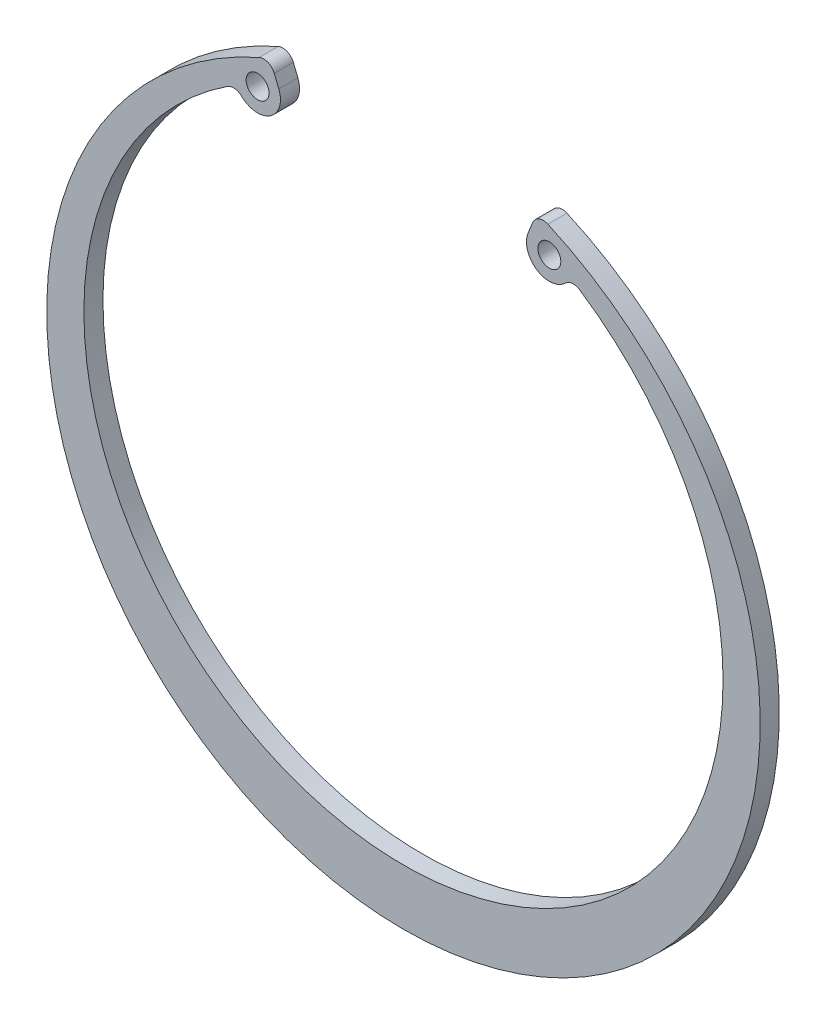
ISO-10303-21;
HEADER;
FILE_DESCRIPTION(('STEP AP214'),'2;1');
FILE_NAME('part.step','',(''),(''),'','','');
FILE_SCHEMA(('AUTOMOTIVE_DESIGN { 1 0 10303 214 1 1 1 1 }'));
ENDSEC;
DATA;
#1=APPLICATION_CONTEXT('core data for automotive mechanical design processes');
#2=APPLICATION_PROTOCOL_DEFINITION('international standard','automotive_design',2000,#1);
#3=PRODUCT_CONTEXT('',#1,'mechanical');
#4=PRODUCT('Part','Part','',(#3));
#5=PRODUCT_RELATED_PRODUCT_CATEGORY('part','',(#4));
#6=PRODUCT_DEFINITION_FORMATION('','',#4);
#7=PRODUCT_DEFINITION_CONTEXT('part definition',#1,'design');
#8=PRODUCT_DEFINITION('design','',#6,#7);
#9=PRODUCT_DEFINITION_SHAPE('','',#8);
#10=(LENGTH_UNIT() NAMED_UNIT(*) SI_UNIT(.MILLI.,.METRE.));
#11=(NAMED_UNIT(*) PLANE_ANGLE_UNIT() SI_UNIT($,.RADIAN.));
#12=(NAMED_UNIT(*) SI_UNIT($,.STERADIAN.) SOLID_ANGLE_UNIT());
#13=UNCERTAINTY_MEASURE_WITH_UNIT(LENGTH_MEASURE(1.E-05),#10,'distance_accuracy_value','');
#14=(GEOMETRIC_REPRESENTATION_CONTEXT(3) GLOBAL_UNCERTAINTY_ASSIGNED_CONTEXT((#13)) GLOBAL_UNIT_ASSIGNED_CONTEXT((#10,
#11,#12)) REPRESENTATION_CONTEXT('',''));
#15=CARTESIAN_POINT('',(0.,0.,0.));
#16=DIRECTION('',(0.,0.,1.));
#17=DIRECTION('',(1.,0.,0.));
#18=AXIS2_PLACEMENT_3D('',#15,#16,#17);
#19=CARTESIAN_POINT('',(16.3384573068,40.4736619647,2.5));
#20=DIRECTION('',(0.927294931547796,-0.374331550801918,0.));
#21=DIRECTION('',(0.374331550801918,0.927294931547796,0.));
#22=AXIS2_PLACEMENT_3D('',#19,#20,#21);
#23=PLANE('',#22);
#24=DIRECTION('',(0.374331550801918,0.927294931547796,0.));
#25=VECTOR('',#24,1.);
#26=CARTESIAN_POINT('',(16.3384573068,40.4736619647,2.5));
#27=LINE('',#26,#25);
#28=CARTESIAN_POINT('',(16.929193530201,41.9370350217967,2.5));
#29=VERTEX_POINT('',#28);
#30=CARTESIAN_POINT('',(16.3384573067783,40.4736619647029,2.5));
#31=VERTEX_POINT('',#30);
#32=EDGE_CURVE('E123',#29,#31,#27,.F.);
#33=ORIENTED_EDGE('',*,*,#32,.F.);
#34=DIRECTION('',(0.,0.,-1.));
#35=VECTOR('',#34,1.);
#36=CARTESIAN_POINT('',(16.9291935301803,41.9370350218079,0.));
#37=LINE('',#36,#35);
#38=CARTESIAN_POINT('',(16.9291935301846,41.9370350217902,0.));
#39=VERTEX_POINT('',#38);
#40=EDGE_CURVE('E172',#39,#29,#37,.F.);
#41=ORIENTED_EDGE('',*,*,#40,.F.);
#42=DIRECTION('',(-0.374331550786946,-0.92729493155384,0.));
#43=VECTOR('',#42,1.);
#44=CARTESIAN_POINT('',(16.9291935302,41.9370350218,0.));
#45=LINE('',#44,#43);
#46=CARTESIAN_POINT('',(16.3384573067692,40.4736619646804,0.));
#47=VERTEX_POINT('',#46);
#48=EDGE_CURVE('E101',#39,#47,#45,.T.);
#49=ORIENTED_EDGE('',*,*,#48,.T.);
#50=DIRECTION('',(0.,0.,1.));
#51=VECTOR('',#50,1.);
#52=CARTESIAN_POINT('',(16.3384573067607,40.4736619647159,2.5));
#53=LINE('',#52,#51);
#54=EDGE_CURVE('E171',#31,#47,#53,.F.);
#55=ORIENTED_EDGE('',*,*,#54,.F.);
#56=EDGE_LOOP('',(#33,#41,#49,#55));
#57=FACE_BOUND('',#56,.T.);
#58=ADVANCED_FACE('F17',(#57),#23,.F.);
#59=CARTESIAN_POINT('',(-17.5,43.3510380499,2.5));
#60=DIRECTION('',(-0.927294931547796,-0.374331550801918,0.));
#61=DIRECTION('',(0.374331550801918,-0.927294931547796,0.));
#62=AXIS2_PLACEMENT_3D('',#59,#60,#61);
#63=PLANE('',#62);
#64=DIRECTION('',(0.374331550801918,-0.927294931547796,0.));
#65=VECTOR('',#64,1.);
#66=CARTESIAN_POINT('',(-17.5,43.3510380499,2.5));
#67=LINE('',#66,#65);
#68=CARTESIAN_POINT('',(-16.3384573067632,40.473661964709,2.5));
#69=VERTEX_POINT('',#68);
#70=CARTESIAN_POINT('',(-16.9291935301859,41.9370350218028,2.5));
#71=VERTEX_POINT('',#70);
#72=EDGE_CURVE('E35',#69,#71,#67,.F.);
#73=ORIENTED_EDGE('',*,*,#72,.F.);
#74=DIRECTION('',(0.,0.,1.));
#75=VECTOR('',#74,1.);
#76=CARTESIAN_POINT('',(-16.3384573067607,40.4736619647159,2.5));
#77=LINE('',#76,#75);
#78=CARTESIAN_POINT('',(-16.3384573067692,40.4736619646804,0.));
#79=VERTEX_POINT('',#78);
#80=EDGE_CURVE('E160',#79,#69,#77,.T.);
#81=ORIENTED_EDGE('',*,*,#80,.F.);
#82=DIRECTION('',(-0.374331550786946,0.92729493155384,0.));
#83=VECTOR('',#82,1.);
#84=CARTESIAN_POINT('',(-16.3384573068,40.4736619647,0.));
#85=LINE('',#84,#83);
#86=CARTESIAN_POINT('',(-16.9291935301846,41.9370350217902,0.));
#87=VERTEX_POINT('',#86);
#88=EDGE_CURVE('E88',#79,#87,#85,.T.);
#89=ORIENTED_EDGE('',*,*,#88,.T.);
#90=DIRECTION('',(0.,0.,1.));
#91=VECTOR('',#90,1.);
#92=CARTESIAN_POINT('',(-16.9291935301803,41.9370350218079,0.));
#93=LINE('',#92,#91);
#94=EDGE_CURVE('E99',#71,#87,#93,.F.);
#95=ORIENTED_EDGE('',*,*,#94,.F.);
#96=EDGE_LOOP('',(#73,#81,#89,#95));
#97=FACE_BOUND('',#96,.T.);
#98=ADVANCED_FACE('F181',(#97),#63,.F.);
#99=CARTESIAN_POINT('',(0.,0.,0.));
#100=DIRECTION('',(0.,0.,1.));
#101=DIRECTION('',(1.,0.,0.));
#102=AXIS2_PLACEMENT_3D('',#99,#100,#101);
#103=PLANE('',#102);
#104=CARTESIAN_POINT('',(-19.1203421014,39.3506673123,0.));
#105=DIRECTION('',(0.,0.,-1.));
#106=DIRECTION('',(-1.,0.,0.));
#107=AXIS2_PLACEMENT_3D('',#104,#105,#106);
#108=CIRCLE('',#107,1.5);
#109=CARTESIAN_POINT('',(-20.6203421014,39.3506673123,0.));
#110=VERTEX_POINT('',#109);
#111=EDGE_CURVE('E148',#110,#110,#108,.F.);
#112=ORIENTED_EDGE('',*,*,#111,.T.);
#113=EDGE_LOOP('',(#112));
#114=FACE_BOUND('',#113,.T.);
#115=CARTESIAN_POINT('',(19.1203421014,39.3506673123,0.));
#116=DIRECTION('',(0.,0.,-1.));
#117=DIRECTION('',(-1.,0.,0.));
#118=AXIS2_PLACEMENT_3D('',#115,#116,#117);
#119=CIRCLE('',#118,1.5);
#120=CARTESIAN_POINT('',(17.6203421014,39.3506673123,0.));
#121=VERTEX_POINT('',#120);
#122=EDGE_CURVE('E151',#121,#121,#119,.F.);
#123=ORIENTED_EDGE('',*,*,#122,.T.);
#124=EDGE_LOOP('',(#123));
#125=FACE_BOUND('',#124,.T.);
#126=CARTESIAN_POINT('',(-22.2604379554,36.1273463497,0.));
#127=DIRECTION('',(0.,0.,-1.));
#128=DIRECTION('',(-1.,0.,0.));
#129=AXIS2_PLACEMENT_3D('',#126,#127,#128);
#130=CIRCLE('',#129,1.5);
#131=CARTESIAN_POINT('',(-21.2137393374052,37.201786670578,0.));
#132=VERTEX_POINT('',#131);
#133=CARTESIAN_POINT('',(-23.0872804712713,37.3788779928688,0.));
#134=VERTEX_POINT('',#133);
#135=EDGE_CURVE('E158',#132,#134,#130,.F.);
#136=ORIENTED_EDGE('',*,*,#135,.T.);
#137=CARTESIAN_POINT('',(0.,2.43333333333,0.));
#138=DIRECTION('',(0.,0.,1.));
#139=DIRECTION('',(1.,0.,0.));
#140=AXIS2_PLACEMENT_3D('',#137,#138,#139);
#141=CIRCLE('',#140,41.8833333333);
#142=CARTESIAN_POINT('',(23.0872804712538,37.3788779928425,0.));
#143=VERTEX_POINT('',#142);
#144=EDGE_CURVE('E162',#134,#143,#141,.T.);
#145=ORIENTED_EDGE('',*,*,#144,.T.);
#146=CARTESIAN_POINT('',(22.2604379554,36.1273463497,0.));
#147=DIRECTION('',(0.,0.,-1.));
#148=DIRECTION('',(-1.,0.,0.));
#149=AXIS2_PLACEMENT_3D('',#146,#147,#148);
#150=CIRCLE('',#149,1.5);
#151=CARTESIAN_POINT('',(21.2137393374052,37.201786670578,0.));
#152=VERTEX_POINT('',#151);
#153=EDGE_CURVE('E165',#143,#152,#150,.F.);
#154=ORIENTED_EDGE('',*,*,#153,.T.);
#155=CARTESIAN_POINT('',(19.1203421014,39.3506673123,0.));
#156=DIRECTION('',(0.,0.,1.));
#157=DIRECTION('',(1.,0.,0.));
#158=AXIS2_PLACEMENT_3D('',#155,#156,#157);
#159=CIRCLE('',#158,3.);
#160=EDGE_CURVE('E169',#47,#152,#159,.T.);
#161=ORIENTED_EDGE('',*,*,#160,.F.);
#162=ORIENTED_EDGE('',*,*,#48,.F.);
#163=CARTESIAN_POINT('',(18.3201359275,41.3755376956,0.));
#164=DIRECTION('',(0.,0.,-1.));
#165=DIRECTION('',(-1.,0.,0.));
#166=AXIS2_PLACEMENT_3D('',#163,#164,#165);
#167=CIRCLE('',#166,1.5);
#168=CARTESIAN_POINT('',(18.9274332510718,42.7471024810723,0.));
#169=VERTEX_POINT('',#168);
#170=EDGE_CURVE('E107',#169,#39,#167,.F.);
#171=ORIENTED_EDGE('',*,*,#170,.F.);
#172=CARTESIAN_POINT('',(0.,0.,0.));
#173=DIRECTION('',(0.,0.,1.));
#174=DIRECTION('',(1.,0.,0.));
#175=AXIS2_PLACEMENT_3D('',#172,#173,#174);
#176=CIRCLE('',#175,46.75);
#177=CARTESIAN_POINT('',(-18.9274332510718,42.7471024810723,0.));
#178=VERTEX_POINT('',#177);
#179=EDGE_CURVE('E103',#178,#169,#176,.T.);
#180=ORIENTED_EDGE('',*,*,#179,.F.);
#181=CARTESIAN_POINT('',(-18.3201359275,41.3755376956,0.));
#182=DIRECTION('',(0.,0.,1.));
#183=DIRECTION('',(1.,0.,0.));
#184=AXIS2_PLACEMENT_3D('',#181,#182,#183);
#185=CIRCLE('',#184,1.5);
#186=EDGE_CURVE('E20',#87,#178,#185,.T.);
#187=ORIENTED_EDGE('',*,*,#186,.F.);
#188=ORIENTED_EDGE('',*,*,#88,.F.);
#189=CARTESIAN_POINT('',(-19.1203421014,39.3506673123,0.));
#190=DIRECTION('',(0.,0.,1.));
#191=DIRECTION('',(1.,0.,0.));
#192=AXIS2_PLACEMENT_3D('',#189,#190,#191);
#193=CIRCLE('',#192,3.);
#194=EDGE_CURVE('E154',#132,#79,#193,.T.);
#195=ORIENTED_EDGE('',*,*,#194,.F.);
#196=EDGE_LOOP('',(#136,#145,#154,#161,#162,#171,#180,#187,#188,#195));
#197=FACE_BOUND('',#196,.T.);
#198=ADVANCED_FACE('F105',(#114,#125,#197),#103,.F.);
#199=CARTESIAN_POINT('',(-18.3201359275,41.3755376956,0.));
#200=DIRECTION('',(0.,0.,1.));
#201=DIRECTION('',(1.,0.,0.));
#202=AXIS2_PLACEMENT_3D('',#199,#200,#201);
#203=CYLINDRICAL_SURFACE('',#202,1.5);
#204=CARTESIAN_POINT('',(-18.3201359275,41.3755376956,2.5));
#205=DIRECTION('',(0.,0.,1.));
#206=DIRECTION('',(1.,0.,0.));
#207=AXIS2_PLACEMENT_3D('',#204,#205,#206);
#208=CIRCLE('',#207,1.5);
#209=CARTESIAN_POINT('',(-18.9274332510672,42.7471024810618,2.5));
#210=VERTEX_POINT('',#209);
#211=EDGE_CURVE('E146',#71,#210,#208,.T.);
#212=ORIENTED_EDGE('',*,*,#211,.F.);
#213=ORIENTED_EDGE('',*,*,#94,.T.);
#214=ORIENTED_EDGE('',*,*,#186,.T.);
#215=DIRECTION('',(0.,0.,1.));
#216=VECTOR('',#215,1.);
#217=CARTESIAN_POINT('',(-18.9274332510805,42.7471024810559,0.));
#218=LINE('',#217,#216);
#219=EDGE_CURVE('E97',#210,#178,#218,.F.);
#220=ORIENTED_EDGE('',*,*,#219,.F.);
#221=EDGE_LOOP('',(#212,#213,#214,#220));
#222=FACE_BOUND('',#221,.T.);
#223=ADVANCED_FACE('F95',(#222),#203,.T.);
#224=CARTESIAN_POINT('',(0.,0.,0.));
#225=DIRECTION('',(0.,0.,1.));
#226=DIRECTION('',(1.,0.,0.));
#227=AXIS2_PLACEMENT_3D('',#224,#225,#226);
#228=CYLINDRICAL_SURFACE('',#227,46.75);
#229=DIRECTION('',(0.,0.,-1.));
#230=VECTOR('',#229,1.);
#231=CARTESIAN_POINT('',(18.9274332510898,42.747102481077,0.));
#232=LINE('',#231,#230);
#233=CARTESIAN_POINT('',(18.9274332510765,42.7471024810829,2.5));
#234=VERTEX_POINT('',#233);
#235=EDGE_CURVE('E110',#234,#169,#232,.T.);
#236=ORIENTED_EDGE('',*,*,#235,.F.);
#237=CARTESIAN_POINT('',(0.,0.,2.5));
#238=DIRECTION('',(0.,0.,1.));
#239=DIRECTION('',(1.,0.,0.));
#240=AXIS2_PLACEMENT_3D('',#237,#238,#239);
#241=CIRCLE('',#240,46.75);
#242=EDGE_CURVE('E113',#210,#234,#241,.T.);
#243=ORIENTED_EDGE('',*,*,#242,.F.);
#244=ORIENTED_EDGE('',*,*,#219,.T.);
#245=ORIENTED_EDGE('',*,*,#179,.T.);
#246=EDGE_LOOP('',(#236,#243,#244,#245));
#247=FACE_BOUND('',#246,.T.);
#248=ADVANCED_FACE('F111',(#247),#228,.T.);
#249=CARTESIAN_POINT('',(18.3201359275,41.3755376956,0.));
#250=DIRECTION('',(0.,0.,-1.));
#251=DIRECTION('',(-1.,0.,0.));
#252=AXIS2_PLACEMENT_3D('',#249,#250,#251);
#253=CYLINDRICAL_SURFACE('',#252,1.5);
#254=ORIENTED_EDGE('',*,*,#170,.T.);
#255=ORIENTED_EDGE('',*,*,#40,.T.);
#256=CARTESIAN_POINT('',(18.3201359275,41.3755376956,2.5));
#257=DIRECTION('',(0.,0.,-1.));
#258=DIRECTION('',(-1.,0.,0.));
#259=AXIS2_PLACEMENT_3D('',#256,#257,#258);
#260=CIRCLE('',#259,1.5);
#261=EDGE_CURVE('E142',#234,#29,#260,.F.);
#262=ORIENTED_EDGE('',*,*,#261,.F.);
#263=ORIENTED_EDGE('',*,*,#235,.T.);
#264=EDGE_LOOP('',(#254,#255,#262,#263));
#265=FACE_BOUND('',#264,.T.);
#266=ADVANCED_FACE('F176',(#265),#253,.T.);
#267=CARTESIAN_POINT('',(19.1203421014,39.3506673123,2.5));
#268=DIRECTION('',(0.,0.,1.));
#269=DIRECTION('',(1.,0.,0.));
#270=AXIS2_PLACEMENT_3D('',#267,#268,#269);
#271=CYLINDRICAL_SURFACE('',#270,3.);
#272=ORIENTED_EDGE('',*,*,#54,.T.);
#273=ORIENTED_EDGE('',*,*,#160,.T.);
#274=DIRECTION('',(0.,0.,-1.));
#275=VECTOR('',#274,1.);
#276=CARTESIAN_POINT('',(21.213739337423,37.2017866705764,2.5));
#277=LINE('',#276,#275);
#278=CARTESIAN_POINT('',(21.2137393374147,37.2017866705683,2.5));
#279=VERTEX_POINT('',#278);
#280=EDGE_CURVE('E168',#152,#279,#277,.F.);
#281=ORIENTED_EDGE('',*,*,#280,.T.);
#282=CARTESIAN_POINT('',(19.1203421014,39.3506673123,2.5));
#283=DIRECTION('',(0.,0.,1.));
#284=DIRECTION('',(1.,0.,0.));
#285=AXIS2_PLACEMENT_3D('',#282,#283,#284);
#286=CIRCLE('',#285,3.);
#287=EDGE_CURVE('E139',#31,#279,#286,.T.);
#288=ORIENTED_EDGE('',*,*,#287,.F.);
#289=EDGE_LOOP('',(#272,#273,#281,#288));
#290=FACE_BOUND('',#289,.T.);
#291=ADVANCED_FACE('F221',(#290),#271,.T.);
#292=CARTESIAN_POINT('',(22.2604379554,36.1273463497,2.5));
#293=DIRECTION('',(0.,0.,-1.));
#294=DIRECTION('',(-1.,0.,0.));
#295=AXIS2_PLACEMENT_3D('',#292,#293,#294);
#296=CYLINDRICAL_SURFACE('',#295,1.5);
#297=DIRECTION('',(0.,0.,1.));
#298=VECTOR('',#297,1.);
#299=CARTESIAN_POINT('',(23.0872804712595,37.3788779928387,2.5));
#300=LINE('',#299,#298);
#301=CARTESIAN_POINT('',(23.0872804712538,37.3788779928425,2.5));
#302=VERTEX_POINT('',#301);
#303=EDGE_CURVE('E164',#143,#302,#300,.T.);
#304=ORIENTED_EDGE('',*,*,#303,.T.);
#305=CARTESIAN_POINT('',(22.2604379554,36.1273463497,2.5));
#306=DIRECTION('',(0.,0.,-1.));
#307=DIRECTION('',(-1.,0.,0.));
#308=AXIS2_PLACEMENT_3D('',#305,#306,#307);
#309=CIRCLE('',#308,1.5);
#310=EDGE_CURVE('E136',#279,#302,#309,.T.);
#311=ORIENTED_EDGE('',*,*,#310,.F.);
#312=ORIENTED_EDGE('',*,*,#280,.F.);
#313=ORIENTED_EDGE('',*,*,#153,.F.);
#314=EDGE_LOOP('',(#304,#311,#312,#313));
#315=FACE_BOUND('',#314,.T.);
#316=ADVANCED_FACE('F217',(#315),#296,.F.);
#317=CARTESIAN_POINT('',(0.,2.43333333333,2.5));
#318=DIRECTION('',(0.,0.,1.));
#319=DIRECTION('',(1.,0.,0.));
#320=AXIS2_PLACEMENT_3D('',#317,#318,#319);
#321=CYLINDRICAL_SURFACE('',#320,41.8833333333);
#322=CARTESIAN_POINT('',(0.,2.43333333333,2.5));
#323=DIRECTION('',(0.,0.,1.));
#324=DIRECTION('',(1.,0.,0.));
#325=AXIS2_PLACEMENT_3D('',#322,#323,#324);
#326=CIRCLE('',#325,41.8833333333);
#327=CARTESIAN_POINT('',(-23.0872804712887,37.3788779928952,2.5));
#328=VERTEX_POINT('',#327);
#329=EDGE_CURVE('E133',#302,#328,#326,.F.);
#330=ORIENTED_EDGE('',*,*,#329,.F.);
#331=ORIENTED_EDGE('',*,*,#303,.F.);
#332=ORIENTED_EDGE('',*,*,#144,.F.);
#333=DIRECTION('',(0.,0.,-1.));
#334=VECTOR('',#333,1.);
#335=CARTESIAN_POINT('',(-23.0872804712944,37.3788779928914,2.5));
#336=LINE('',#335,#334);
#337=EDGE_CURVE('E161',#134,#328,#336,.F.);
#338=ORIENTED_EDGE('',*,*,#337,.T.);
#339=EDGE_LOOP('',(#330,#331,#332,#338));
#340=FACE_BOUND('',#339,.T.);
#341=ADVANCED_FACE('F213',(#340),#321,.F.);
#342=CARTESIAN_POINT('',(-22.2604379554,36.1273463497,2.5));
#343=DIRECTION('',(0.,0.,-1.));
#344=DIRECTION('',(-1.,0.,0.));
#345=AXIS2_PLACEMENT_3D('',#342,#343,#344);
#346=CYLINDRICAL_SURFACE('',#345,1.5);
#347=DIRECTION('',(0.,0.,1.));
#348=VECTOR('',#347,1.);
#349=CARTESIAN_POINT('',(-21.213739337404,37.2017866705959,2.5));
#350=LINE('',#349,#348);
#351=CARTESIAN_POINT('',(-21.2137393373957,37.2017866705878,2.5));
#352=VERTEX_POINT('',#351);
#353=EDGE_CURVE('E157',#352,#132,#350,.F.);
#354=ORIENTED_EDGE('',*,*,#353,.F.);
#355=CARTESIAN_POINT('',(-22.2604379554,36.1273463497,2.5));
#356=DIRECTION('',(0.,0.,-1.));
#357=DIRECTION('',(-1.,0.,0.));
#358=AXIS2_PLACEMENT_3D('',#355,#356,#357);
#359=CIRCLE('',#358,1.5);
#360=EDGE_CURVE('E130',#328,#352,#359,.T.);
#361=ORIENTED_EDGE('',*,*,#360,.F.);
#362=ORIENTED_EDGE('',*,*,#337,.F.);
#363=ORIENTED_EDGE('',*,*,#135,.F.);
#364=EDGE_LOOP('',(#354,#361,#362,#363));
#365=FACE_BOUND('',#364,.T.);
#366=ADVANCED_FACE('F209',(#365),#346,.F.);
#367=CARTESIAN_POINT('',(-19.1203421014,39.3506673123,2.5));
#368=DIRECTION('',(0.,0.,1.));
#369=DIRECTION('',(1.,0.,0.));
#370=AXIS2_PLACEMENT_3D('',#367,#368,#369);
#371=CYLINDRICAL_SURFACE('',#370,3.);
#372=ORIENTED_EDGE('',*,*,#353,.T.);
#373=ORIENTED_EDGE('',*,*,#194,.T.);
#374=ORIENTED_EDGE('',*,*,#80,.T.);
#375=CARTESIAN_POINT('',(-19.1203421014,39.3506673123,2.5));
#376=DIRECTION('',(0.,0.,1.));
#377=DIRECTION('',(1.,0.,0.));
#378=AXIS2_PLACEMENT_3D('',#375,#376,#377);
#379=CIRCLE('',#378,3.);
#380=EDGE_CURVE('E127',#352,#69,#379,.T.);
#381=ORIENTED_EDGE('',*,*,#380,.F.);
#382=EDGE_LOOP('',(#372,#373,#374,#381));
#383=FACE_BOUND('',#382,.T.);
#384=ADVANCED_FACE('F205',(#383),#371,.T.);
#385=CARTESIAN_POINT('',(19.1203421014,39.3506673123,2.5));
#386=DIRECTION('',(0.,0.,-1.));
#387=DIRECTION('',(-1.,0.,0.));
#388=AXIS2_PLACEMENT_3D('',#385,#386,#387);
#389=CYLINDRICAL_SURFACE('',#388,1.5);
#390=CARTESIAN_POINT('',(19.1203421014,39.3506673123,2.5));
#391=DIRECTION('',(0.,0.,-1.));
#392=DIRECTION('',(-1.,0.,0.));
#393=AXIS2_PLACEMENT_3D('',#390,#391,#392);
#394=CIRCLE('',#393,1.5);
#395=CARTESIAN_POINT('',(17.6203421014,39.3506673123,2.5));
#396=VERTEX_POINT('',#395);
#397=EDGE_CURVE('E26',#396,#396,#394,.T.);
#398=ORIENTED_EDGE('',*,*,#397,.F.);
#399=EDGE_LOOP('',(#398));
#400=FACE_BOUND('',#399,.T.);
#401=ORIENTED_EDGE('',*,*,#122,.F.);
#402=EDGE_LOOP('',(#401));
#403=FACE_BOUND('',#402,.T.);
#404=ADVANCED_FACE('F198',(#400,#403),#389,.F.);
#405=CARTESIAN_POINT('',(-19.1203421014,39.3506673123,2.5));
#406=DIRECTION('',(0.,0.,-1.));
#407=DIRECTION('',(-1.,0.,0.));
#408=AXIS2_PLACEMENT_3D('',#405,#406,#407);
#409=CYLINDRICAL_SURFACE('',#408,1.5);
#410=CARTESIAN_POINT('',(-19.1203421014,39.3506673123,2.5));
#411=DIRECTION('',(0.,0.,-1.));
#412=DIRECTION('',(-1.,0.,0.));
#413=AXIS2_PLACEMENT_3D('',#410,#411,#412);
#414=CIRCLE('',#413,1.5);
#415=CARTESIAN_POINT('',(-20.6203421014,39.3506673123,2.5));
#416=VERTEX_POINT('',#415);
#417=EDGE_CURVE('E11',#416,#416,#414,.T.);
#418=ORIENTED_EDGE('',*,*,#417,.F.);
#419=EDGE_LOOP('',(#418));
#420=FACE_BOUND('',#419,.T.);
#421=ORIENTED_EDGE('',*,*,#111,.F.);
#422=EDGE_LOOP('',(#421));
#423=FACE_BOUND('',#422,.T.);
#424=ADVANCED_FACE('F192',(#420,#423),#409,.F.);
#425=CARTESIAN_POINT('',(0.,0.,2.5));
#426=DIRECTION('',(0.,0.,1.));
#427=DIRECTION('',(1.,0.,0.));
#428=AXIS2_PLACEMENT_3D('',#425,#426,#427);
#429=PLANE('',#428);
#430=ORIENTED_EDGE('',*,*,#417,.T.);
#431=EDGE_LOOP('',(#430));
#432=FACE_BOUND('',#431,.T.);
#433=ORIENTED_EDGE('',*,*,#397,.T.);
#434=EDGE_LOOP('',(#433));
#435=FACE_BOUND('',#434,.T.);
#436=ORIENTED_EDGE('',*,*,#380,.T.);
#437=ORIENTED_EDGE('',*,*,#72,.T.);
#438=ORIENTED_EDGE('',*,*,#211,.T.);
#439=ORIENTED_EDGE('',*,*,#242,.T.);
#440=ORIENTED_EDGE('',*,*,#261,.T.);
#441=ORIENTED_EDGE('',*,*,#32,.T.);
#442=ORIENTED_EDGE('',*,*,#287,.T.);
#443=ORIENTED_EDGE('',*,*,#310,.T.);
#444=ORIENTED_EDGE('',*,*,#329,.T.);
#445=ORIENTED_EDGE('',*,*,#360,.T.);
#446=EDGE_LOOP('',(#436,#437,#438,#439,#440,#441,#442,#443,#444,#445));
#447=FACE_BOUND('',#446,.T.);
#448=ADVANCED_FACE('F179',(#432,#435,#447),#429,.T.);
#449=CLOSED_SHELL('',(#58,#98,#198,#223,#248,#266,#291,#316,#341,#366,#384,#404,#424,#448));
#450=MANIFOLD_SOLID_BREP('B1',#449);
#451=ADVANCED_BREP_SHAPE_REPRESENTATION('',(#18,#450),#14);
#452=SHAPE_DEFINITION_REPRESENTATION(#9,#451);
ENDSEC;
END-ISO-10303-21;
